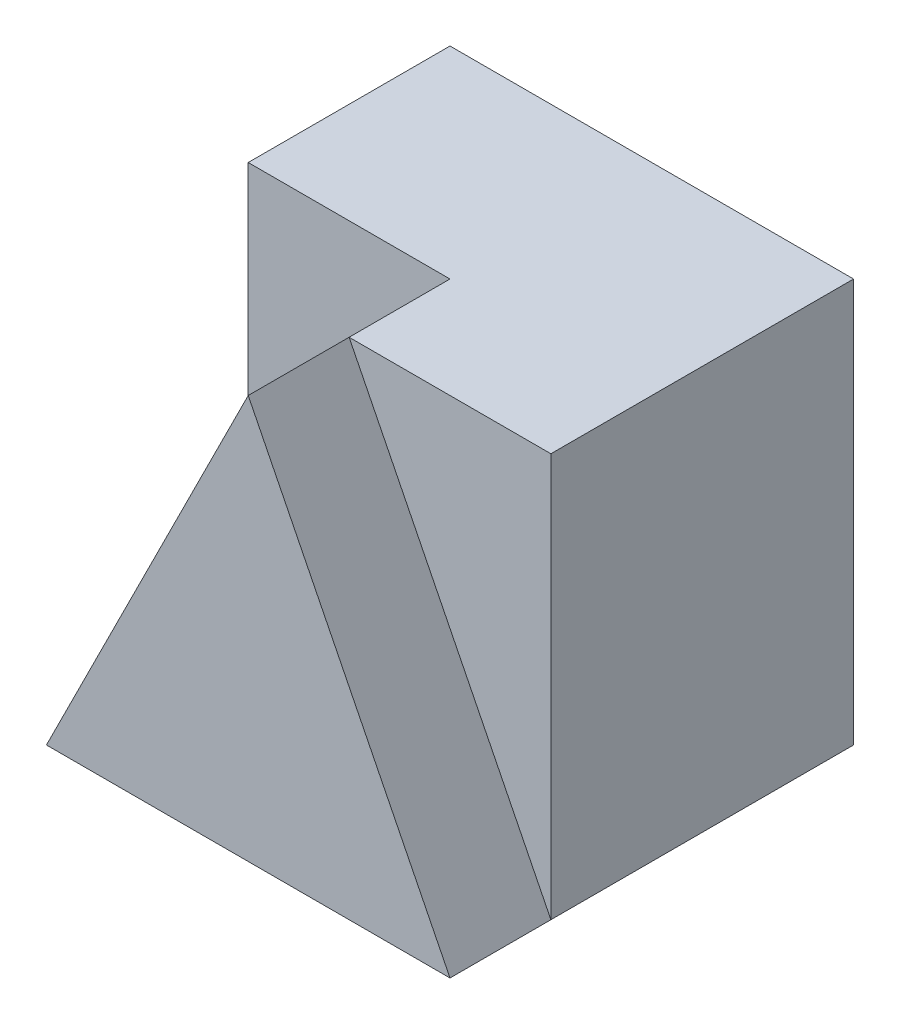
ISO-10303-21;
HEADER;
FILE_DESCRIPTION(('STEP AP214'),'2;1');
FILE_NAME('part.step','',(''),(''),'','','');
FILE_SCHEMA(('AUTOMOTIVE_DESIGN { 1 0 10303 214 1 1 1 1 }'));
ENDSEC;
DATA;
#1=APPLICATION_CONTEXT('core data for automotive mechanical design processes');
#2=APPLICATION_PROTOCOL_DEFINITION('international standard','automotive_design',2000,#1);
#3=PRODUCT_CONTEXT('',#1,'mechanical');
#4=PRODUCT('Part','Part','',(#3));
#5=PRODUCT_RELATED_PRODUCT_CATEGORY('part','',(#4));
#6=PRODUCT_DEFINITION_FORMATION('','',#4);
#7=PRODUCT_DEFINITION_CONTEXT('part definition',#1,'design');
#8=PRODUCT_DEFINITION('design','',#6,#7);
#9=PRODUCT_DEFINITION_SHAPE('','',#8);
#10=(LENGTH_UNIT() NAMED_UNIT(*) SI_UNIT(.MILLI.,.METRE.));
#11=(NAMED_UNIT(*) PLANE_ANGLE_UNIT() SI_UNIT($,.RADIAN.));
#12=(NAMED_UNIT(*) SI_UNIT($,.STERADIAN.) SOLID_ANGLE_UNIT());
#13=UNCERTAINTY_MEASURE_WITH_UNIT(LENGTH_MEASURE(1.E-05),#10,'distance_accuracy_value','');
#14=(GEOMETRIC_REPRESENTATION_CONTEXT(3) GLOBAL_UNCERTAINTY_ASSIGNED_CONTEXT((#13)) GLOBAL_UNIT_ASSIGNED_CONTEXT((#10,
#11,#12)) REPRESENTATION_CONTEXT('',''));
#15=CARTESIAN_POINT('',(0.,0.,0.));
#16=DIRECTION('',(0.,0.,1.));
#17=DIRECTION('',(1.,0.,0.));
#18=AXIS2_PLACEMENT_3D('',#15,#16,#17);
#19=CARTESIAN_POINT('',(-2.,4.,2.));
#20=DIRECTION('',(1.,0.,0.));
#21=DIRECTION('',(0.,0.,-1.));
#22=AXIS2_PLACEMENT_3D('',#19,#20,#21);
#23=PLANE('',#22);
#24=DIRECTION('',(0.,-1.,0.));
#25=VECTOR('',#24,1.);
#26=CARTESIAN_POINT('',(-2.,0.,0.));
#27=LINE('',#26,#25);
#28=CARTESIAN_POINT('',(-2.,4.,0.));
#29=VERTEX_POINT('',#28);
#30=CARTESIAN_POINT('',(-2.,0.,0.));
#31=VERTEX_POINT('',#30);
#32=EDGE_CURVE('E131',#29,#31,#27,.T.);
#33=ORIENTED_EDGE('',*,*,#32,.F.);
#34=DIRECTION('',(0.,0.,1.));
#35=VECTOR('',#34,1.);
#36=CARTESIAN_POINT('',(-2.,4.,2.));
#37=LINE('',#36,#35);
#38=CARTESIAN_POINT('',(-2.,4.,-2.));
#39=VERTEX_POINT('',#38);
#40=EDGE_CURVE('E102',#39,#29,#37,.T.);
#41=ORIENTED_EDGE('',*,*,#40,.F.);
#42=DIRECTION('',(0.,-1.,0.));
#43=VECTOR('',#42,1.);
#44=CARTESIAN_POINT('',(-2.,4.,-2.));
#45=LINE('',#44,#43);
#46=CARTESIAN_POINT('',(-2.,0.,-2.));
#47=VERTEX_POINT('',#46);
#48=EDGE_CURVE('E42',#39,#47,#45,.T.);
#49=ORIENTED_EDGE('',*,*,#48,.T.);
#50=DIRECTION('',(0.,0.,1.));
#51=VECTOR('',#50,1.);
#52=CARTESIAN_POINT('',(-2.,0.,2.));
#53=LINE('',#52,#51);
#54=EDGE_CURVE('E94',#47,#31,#53,.T.);
#55=ORIENTED_EDGE('',*,*,#54,.T.);
#56=EDGE_LOOP('',(#33,#41,#49,#55));
#57=FACE_BOUND('',#56,.T.);
#58=ADVANCED_FACE('F33',(#57),#23,.F.);
#59=CARTESIAN_POINT('',(2.,4.,2.));
#60=DIRECTION('',(-1.,0.,0.));
#61=DIRECTION('',(0.,0.,1.));
#62=AXIS2_PLACEMENT_3D('',#59,#60,#61);
#63=PLANE('',#62);
#64=DIRECTION('',(0.,0.,-1.));
#65=VECTOR('',#64,1.);
#66=CARTESIAN_POINT('',(2.,4.,2.));
#67=LINE('',#66,#65);
#68=CARTESIAN_POINT('',(2.,4.,1.));
#69=VERTEX_POINT('',#68);
#70=CARTESIAN_POINT('',(2.,4.,-2.));
#71=VERTEX_POINT('',#70);
#72=EDGE_CURVE('E93',#69,#71,#67,.T.);
#73=ORIENTED_EDGE('',*,*,#72,.F.);
#74=DIRECTION('',(0.,1.,0.));
#75=VECTOR('',#74,1.);
#76=CARTESIAN_POINT('',(2.,4.,1.));
#77=LINE('',#76,#75);
#78=CARTESIAN_POINT('',(2.,0.,1.));
#79=VERTEX_POINT('',#78);
#80=EDGE_CURVE('E117',#79,#69,#77,.T.);
#81=ORIENTED_EDGE('',*,*,#80,.F.);
#82=DIRECTION('',(0.,0.,-1.));
#83=VECTOR('',#82,1.);
#84=CARTESIAN_POINT('',(2.,0.,2.));
#85=LINE('',#84,#83);
#86=CARTESIAN_POINT('',(2.,0.,-2.));
#87=VERTEX_POINT('',#86);
#88=EDGE_CURVE('E98',#79,#87,#85,.T.);
#89=ORIENTED_EDGE('',*,*,#88,.T.);
#90=DIRECTION('',(0.,-1.,0.));
#91=VECTOR('',#90,1.);
#92=CARTESIAN_POINT('',(2.,4.,-2.));
#93=LINE('',#92,#91);
#94=EDGE_CURVE('E11',#71,#87,#93,.T.);
#95=ORIENTED_EDGE('',*,*,#94,.F.);
#96=EDGE_LOOP('',(#73,#81,#89,#95));
#97=FACE_BOUND('',#96,.T.);
#98=ADVANCED_FACE('F35',(#97),#63,.F.);
#99=CARTESIAN_POINT('',(-2.,4.,-2.));
#100=DIRECTION('',(0.,0.,1.));
#101=DIRECTION('',(1.,0.,0.));
#102=AXIS2_PLACEMENT_3D('',#99,#100,#101);
#103=PLANE('',#102);
#104=DIRECTION('',(-1.,0.,0.));
#105=VECTOR('',#104,1.);
#106=CARTESIAN_POINT('',(-2.,0.,-2.));
#107=LINE('',#106,#105);
#108=EDGE_CURVE('E62',#87,#47,#107,.T.);
#109=ORIENTED_EDGE('',*,*,#108,.T.);
#110=ORIENTED_EDGE('',*,*,#48,.F.);
#111=DIRECTION('',(-1.,0.,0.));
#112=VECTOR('',#111,1.);
#113=CARTESIAN_POINT('',(-2.,4.,-2.));
#114=LINE('',#113,#112);
#115=EDGE_CURVE('E50',#71,#39,#114,.T.);
#116=ORIENTED_EDGE('',*,*,#115,.F.);
#117=ORIENTED_EDGE('',*,*,#94,.T.);
#118=EDGE_LOOP('',(#109,#110,#116,#117));
#119=FACE_BOUND('',#118,.T.);
#120=ADVANCED_FACE('F160',(#119),#103,.F.);
#121=CARTESIAN_POINT('',(-2.,4.,2.));
#122=DIRECTION('',(0.,0.,-1.));
#123=DIRECTION('',(-1.,0.,0.));
#124=AXIS2_PLACEMENT_3D('',#121,#122,#123);
#125=PLANE('',#124);
#126=DIRECTION('',(0.447213595499958,-0.894427190999916,0.));
#127=VECTOR('',#126,1.);
#128=CARTESIAN_POINT('',(2.,0.,2.));
#129=LINE('',#128,#127);
#130=CARTESIAN_POINT('',(0.,4.,2.));
#131=VERTEX_POINT('',#130);
#132=CARTESIAN_POINT('',(2.,0.,2.));
#133=VERTEX_POINT('',#132);
#134=EDGE_CURVE('E69',#131,#133,#129,.T.);
#135=ORIENTED_EDGE('',*,*,#134,.F.);
#136=DIRECTION('',(0.447213595499958,0.894427190999916,0.));
#137=VECTOR('',#136,1.);
#138=CARTESIAN_POINT('',(0.,4.,2.));
#139=LINE('',#138,#137);
#140=CARTESIAN_POINT('',(-2.,0.,2.));
#141=VERTEX_POINT('',#140);
#142=EDGE_CURVE('E90',#141,#131,#139,.T.);
#143=ORIENTED_EDGE('',*,*,#142,.F.);
#144=DIRECTION('',(1.,0.,0.));
#145=VECTOR('',#144,1.);
#146=CARTESIAN_POINT('',(-2.,0.,2.));
#147=LINE('',#146,#145);
#148=EDGE_CURVE('E86',#141,#133,#147,.T.);
#149=ORIENTED_EDGE('',*,*,#148,.T.);
#150=EDGE_LOOP('',(#135,#143,#149));
#151=FACE_BOUND('',#150,.T.);
#152=ADVANCED_FACE('F87',(#151),#125,.F.);
#153=CARTESIAN_POINT('',(0.,4.,0.));
#154=DIRECTION('',(0.,-1.,0.));
#155=DIRECTION('',(0.,0.,-1.));
#156=AXIS2_PLACEMENT_3D('',#153,#154,#155);
#157=PLANE('',#156);
#158=DIRECTION('',(-1.,0.,0.));
#159=VECTOR('',#158,1.);
#160=CARTESIAN_POINT('',(-2.,4.,0.));
#161=LINE('',#160,#159);
#162=CARTESIAN_POINT('',(0.,4.,0.));
#163=VERTEX_POINT('',#162);
#164=EDGE_CURVE('E128',#163,#29,#161,.T.);
#165=ORIENTED_EDGE('',*,*,#164,.F.);
#166=DIRECTION('',(0.,0.,1.));
#167=VECTOR('',#166,1.);
#168=CARTESIAN_POINT('',(0.,4.,0.));
#169=LINE('',#168,#167);
#170=CARTESIAN_POINT('',(0.,4.,1.));
#171=VERTEX_POINT('',#170);
#172=EDGE_CURVE('E83',#163,#171,#169,.T.);
#173=ORIENTED_EDGE('',*,*,#172,.T.);
#174=DIRECTION('',(-1.,0.,0.));
#175=VECTOR('',#174,1.);
#176=CARTESIAN_POINT('',(0.,4.,1.));
#177=LINE('',#176,#175);
#178=EDGE_CURVE('E113',#69,#171,#177,.T.);
#179=ORIENTED_EDGE('',*,*,#178,.F.);
#180=ORIENTED_EDGE('',*,*,#72,.T.);
#181=ORIENTED_EDGE('',*,*,#115,.T.);
#182=ORIENTED_EDGE('',*,*,#40,.T.);
#183=EDGE_LOOP('',(#165,#173,#179,#180,#181,#182));
#184=FACE_BOUND('',#183,.T.);
#185=ADVANCED_FACE('F158',(#184),#157,.F.);
#186=CARTESIAN_POINT('',(0.,0.,0.));
#187=DIRECTION('',(0.,-1.,0.));
#188=DIRECTION('',(0.,0.,-1.));
#189=AXIS2_PLACEMENT_3D('',#186,#187,#188);
#190=PLANE('',#189);
#191=EDGE_CURVE('E75',#133,#79,#85,.T.);
#192=ORIENTED_EDGE('',*,*,#191,.F.);
#193=ORIENTED_EDGE('',*,*,#148,.F.);
#194=DIRECTION('',(0.,0.,1.));
#195=VECTOR('',#194,1.);
#196=CARTESIAN_POINT('',(-2.,0.,0.));
#197=LINE('',#196,#195);
#198=EDGE_CURVE('E121',#31,#141,#197,.T.);
#199=ORIENTED_EDGE('',*,*,#198,.F.);
#200=ORIENTED_EDGE('',*,*,#54,.F.);
#201=ORIENTED_EDGE('',*,*,#108,.F.);
#202=ORIENTED_EDGE('',*,*,#88,.F.);
#203=EDGE_LOOP('',(#192,#193,#199,#200,#201,#202));
#204=FACE_BOUND('',#203,.T.);
#205=ADVANCED_FACE('F97',(#204),#190,.T.);
#206=CARTESIAN_POINT('',(2.,0.,1.));
#207=DIRECTION('',(-0.894427190999916,-0.447213595499958,0.));
#208=DIRECTION('',(0.447213595499958,-0.894427190999916,0.));
#209=AXIS2_PLACEMENT_3D('',#206,#207,#208);
#210=PLANE('',#209);
#211=ORIENTED_EDGE('',*,*,#134,.T.);
#212=ORIENTED_EDGE('',*,*,#191,.T.);
#213=DIRECTION('',(0.447213595499958,-0.894427190999916,0.));
#214=VECTOR('',#213,1.);
#215=CARTESIAN_POINT('',(2.,0.,1.));
#216=LINE('',#215,#214);
#217=EDGE_CURVE('E82',#171,#79,#216,.T.);
#218=ORIENTED_EDGE('',*,*,#217,.F.);
#219=DIRECTION('',(0.,0.,1.));
#220=VECTOR('',#219,1.);
#221=CARTESIAN_POINT('',(0.,4.,1.));
#222=LINE('',#221,#220);
#223=EDGE_CURVE('E79',#171,#131,#222,.T.);
#224=ORIENTED_EDGE('',*,*,#223,.T.);
#225=EDGE_LOOP('',(#211,#212,#218,#224));
#226=FACE_BOUND('',#225,.T.);
#227=ADVANCED_FACE('F71',(#226),#210,.F.);
#228=CARTESIAN_POINT('',(0.,0.,1.));
#229=DIRECTION('',(0.,0.,-1.));
#230=DIRECTION('',(-1.,0.,0.));
#231=AXIS2_PLACEMENT_3D('',#228,#229,#230);
#232=PLANE('',#231);
#233=ORIENTED_EDGE('',*,*,#217,.T.);
#234=ORIENTED_EDGE('',*,*,#80,.T.);
#235=ORIENTED_EDGE('',*,*,#178,.T.);
#236=EDGE_LOOP('',(#233,#234,#235));
#237=FACE_BOUND('',#236,.T.);
#238=ADVANCED_FACE('F155',(#237),#232,.F.);
#239=CARTESIAN_POINT('',(0.,4.,0.));
#240=DIRECTION('',(0.894427190999916,-0.447213595499958,0.));
#241=DIRECTION('',(0.447213595499958,0.894427190999916,0.));
#242=AXIS2_PLACEMENT_3D('',#239,#240,#241);
#243=PLANE('',#242);
#244=ORIENTED_EDGE('',*,*,#142,.T.);
#245=ORIENTED_EDGE('',*,*,#223,.F.);
#246=ORIENTED_EDGE('',*,*,#172,.F.);
#247=DIRECTION('',(0.447213595499958,0.894427190999916,0.));
#248=VECTOR('',#247,1.);
#249=CARTESIAN_POINT('',(0.,4.,0.));
#250=LINE('',#249,#248);
#251=EDGE_CURVE('E124',#31,#163,#250,.T.);
#252=ORIENTED_EDGE('',*,*,#251,.F.);
#253=ORIENTED_EDGE('',*,*,#198,.T.);
#254=EDGE_LOOP('',(#244,#245,#246,#252,#253));
#255=FACE_BOUND('',#254,.T.);
#256=ADVANCED_FACE('F144',(#255),#243,.F.);
#257=CARTESIAN_POINT('',(0.,0.,0.));
#258=DIRECTION('',(0.,0.,1.));
#259=DIRECTION('',(1.,0.,0.));
#260=AXIS2_PLACEMENT_3D('',#257,#258,#259);
#261=PLANE('',#260);
#262=ORIENTED_EDGE('',*,*,#164,.T.);
#263=ORIENTED_EDGE('',*,*,#32,.T.);
#264=ORIENTED_EDGE('',*,*,#251,.T.);
#265=EDGE_LOOP('',(#262,#263,#264));
#266=FACE_BOUND('',#265,.T.);
#267=ADVANCED_FACE('F137',(#266),#261,.T.);
#268=CLOSED_SHELL('',(#58,#98,#120,#152,#185,#205,#227,#238,#256,#267));
#269=MANIFOLD_SOLID_BREP('B2',#268);
#270=ADVANCED_BREP_SHAPE_REPRESENTATION('',(#18,#269),#14);
#271=SHAPE_DEFINITION_REPRESENTATION(#9,#270);
ENDSEC;
END-ISO-10303-21;
